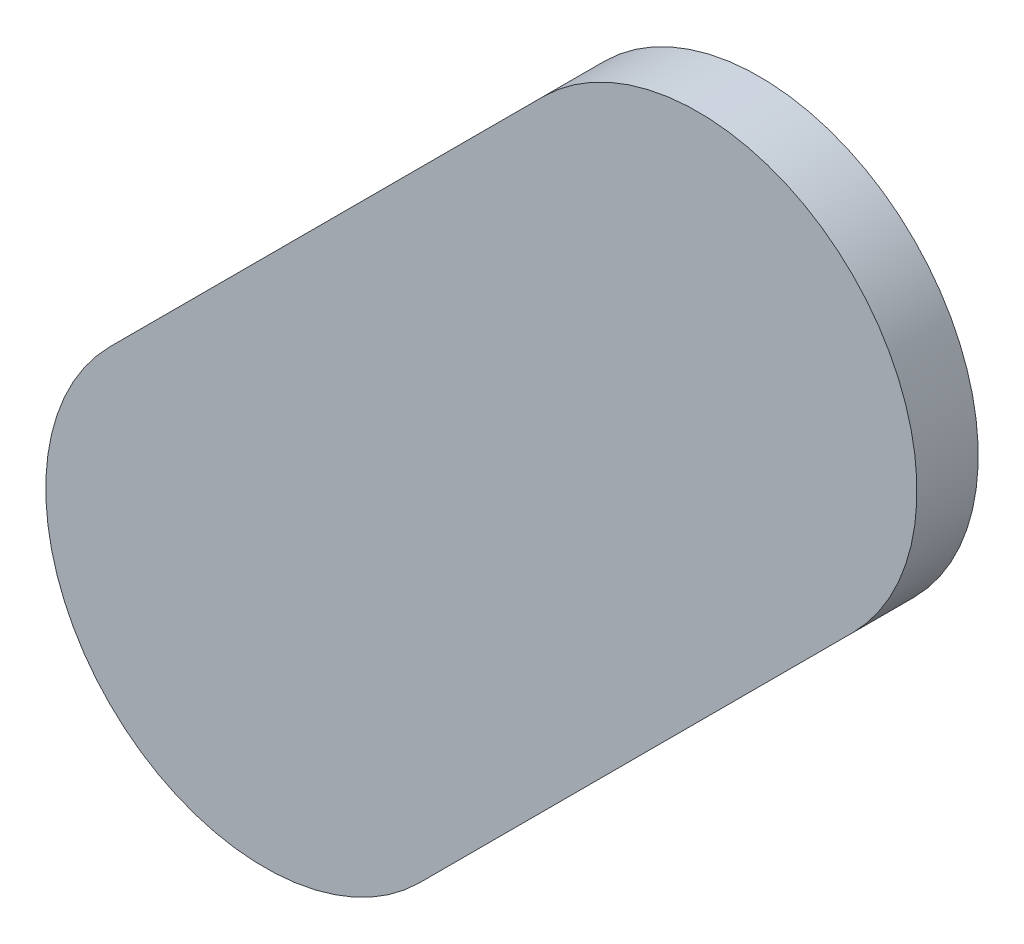
ISO-10303-21;
HEADER;
FILE_DESCRIPTION(('STEP AP214'),'2;1');
FILE_NAME('part.step','',(''),(''),'','','');
FILE_SCHEMA(('AUTOMOTIVE_DESIGN { 1 0 10303 214 1 1 1 1 }'));
ENDSEC;
DATA;
#1=APPLICATION_CONTEXT('core data for automotive mechanical design processes');
#2=APPLICATION_PROTOCOL_DEFINITION('international standard','automotive_design',2000,#1);
#3=PRODUCT_CONTEXT('',#1,'mechanical');
#4=PRODUCT('Part','Part','',(#3));
#5=PRODUCT_RELATED_PRODUCT_CATEGORY('part','',(#4));
#6=PRODUCT_DEFINITION_FORMATION('','',#4);
#7=PRODUCT_DEFINITION_CONTEXT('part definition',#1,'design');
#8=PRODUCT_DEFINITION('design','',#6,#7);
#9=PRODUCT_DEFINITION_SHAPE('','',#8);
#10=(LENGTH_UNIT() NAMED_UNIT(*) SI_UNIT(.MILLI.,.METRE.));
#11=(NAMED_UNIT(*) PLANE_ANGLE_UNIT() SI_UNIT($,.RADIAN.));
#12=(NAMED_UNIT(*) SI_UNIT($,.STERADIAN.) SOLID_ANGLE_UNIT());
#13=UNCERTAINTY_MEASURE_WITH_UNIT(LENGTH_MEASURE(1.E-05),#10,'distance_accuracy_value','');
#14=(GEOMETRIC_REPRESENTATION_CONTEXT(3) GLOBAL_UNCERTAINTY_ASSIGNED_CONTEXT((#13)) GLOBAL_UNIT_ASSIGNED_CONTEXT((#10,
#11,#12)) REPRESENTATION_CONTEXT('',''));
#15=CARTESIAN_POINT('',(0.,0.,0.));
#16=DIRECTION('',(0.,0.,1.));
#17=DIRECTION('',(1.,0.,0.));
#18=AXIS2_PLACEMENT_3D('',#15,#16,#17);
#19=CARTESIAN_POINT('',(86.75982394,100.84573684,0.));
#20=DIRECTION('',(-0.707106781186548,0.707106781186548,0.));
#21=DIRECTION('',(0.707106781186548,0.707106781186548,0.));
#22=AXIS2_PLACEMENT_3D('',#19,#20,#21);
#23=PLANE('',#22);
#24=DIRECTION('',(0.707106781186548,0.707106781186548,0.));
#25=VECTOR('',#24,1.);
#26=CARTESIAN_POINT('',(86.75982394,100.84573684,0.03556));
#27=LINE('',#26,#25);
#28=CARTESIAN_POINT('',(86.75982394,100.84573684,0.03556));
#29=VERTEX_POINT('',#28);
#30=CARTESIAN_POINT('',(87.0113322,101.0972451,0.03556));
#31=VERTEX_POINT('',#30);
#32=EDGE_CURVE('E11',#29,#31,#27,.T.);
#33=ORIENTED_EDGE('',*,*,#32,.F.);
#34=DIRECTION('',(0.,0.,1.));
#35=VECTOR('',#34,1.);
#36=CARTESIAN_POINT('',(86.75982394,100.84573684,0.));
#37=LINE('',#36,#35);
#38=CARTESIAN_POINT('',(86.75982394,100.84573684,0.));
#39=VERTEX_POINT('',#38);
#40=EDGE_CURVE('E24',#39,#29,#37,.T.);
#41=ORIENTED_EDGE('',*,*,#40,.F.);
#42=DIRECTION('',(0.707106781186548,0.707106781186548,0.));
#43=VECTOR('',#42,1.);
#44=CARTESIAN_POINT('',(86.75982394,100.84573684,0.));
#45=LINE('',#44,#43);
#46=CARTESIAN_POINT('',(87.0113322,101.0972451,0.));
#47=VERTEX_POINT('',#46);
#48=EDGE_CURVE('E75',#39,#47,#45,.T.);
#49=ORIENTED_EDGE('',*,*,#48,.T.);
#50=DIRECTION('',(0.,0.,1.));
#51=VECTOR('',#50,1.);
#52=CARTESIAN_POINT('',(87.0113322,101.0972451,0.));
#53=LINE('',#52,#51);
#54=EDGE_CURVE('E37',#47,#31,#53,.T.);
#55=ORIENTED_EDGE('',*,*,#54,.T.);
#56=EDGE_LOOP('',(#33,#41,#49,#55));
#57=FACE_BOUND('',#56,.T.);
#58=ADVANCED_FACE('F17',(#57),#23,.F.);
#59=CARTESIAN_POINT('',(86.92152923,101.18704807,0.));
#60=DIRECTION('',(0.,0.,-1.));
#61=DIRECTION('',(0.707106781186492,-0.707106781186604,0.));
#62=AXIS2_PLACEMENT_3D('',#59,#60,#61);
#63=CYLINDRICAL_SURFACE('',#62,0.127000578115382);
#64=CARTESIAN_POINT('',(86.92152923,101.18704807,0.03556));
#65=DIRECTION('',(0.,0.,1.));
#66=DIRECTION('',(0.707106781186492,-0.707106781186604,0.));
#67=AXIS2_PLACEMENT_3D('',#64,#65,#66);
#68=CIRCLE('',#67,0.127000578115382);
#69=CARTESIAN_POINT('',(86.83172626,101.27685104,0.03556));
#70=VERTEX_POINT('',#69);
#71=EDGE_CURVE('E83',#31,#70,#68,.T.);
#72=ORIENTED_EDGE('',*,*,#71,.F.);
#73=ORIENTED_EDGE('',*,*,#54,.F.);
#74=CARTESIAN_POINT('',(86.92152923,101.18704807,0.));
#75=DIRECTION('',(0.,0.,1.));
#76=DIRECTION('',(0.707106781186492,-0.707106781186604,0.));
#77=AXIS2_PLACEMENT_3D('',#74,#75,#76);
#78=CIRCLE('',#77,0.127000578115382);
#79=CARTESIAN_POINT('',(86.83172626,101.27685104,0.));
#80=VERTEX_POINT('',#79);
#81=EDGE_CURVE('E81',#47,#80,#78,.T.);
#82=ORIENTED_EDGE('',*,*,#81,.T.);
#83=DIRECTION('',(0.,0.,1.));
#84=VECTOR('',#83,1.);
#85=CARTESIAN_POINT('',(86.83172626,101.27685104,0.));
#86=LINE('',#85,#84);
#87=EDGE_CURVE('E67',#80,#70,#86,.T.);
#88=ORIENTED_EDGE('',*,*,#87,.T.);
#89=EDGE_LOOP('',(#72,#73,#82,#88));
#90=FACE_BOUND('',#89,.T.);
#91=ADVANCED_FACE('F89',(#90),#63,.T.);
#92=CARTESIAN_POINT('',(86.83172626,101.27685104,0.));
#93=DIRECTION('',(0.707106781186548,-0.707106781186548,0.));
#94=DIRECTION('',(-0.707106781186548,-0.707106781186548,0.));
#95=AXIS2_PLACEMENT_3D('',#92,#93,#94);
#96=PLANE('',#95);
#97=DIRECTION('',(-0.707106781186548,-0.707106781186548,0.));
#98=VECTOR('',#97,1.);
#99=CARTESIAN_POINT('',(86.83172626,101.27685104,0.03556));
#100=LINE('',#99,#98);
#101=CARTESIAN_POINT('',(86.580218,101.02534278,0.03556));
#102=VERTEX_POINT('',#101);
#103=EDGE_CURVE('E71',#70,#102,#100,.T.);
#104=ORIENTED_EDGE('',*,*,#103,.F.);
#105=ORIENTED_EDGE('',*,*,#87,.F.);
#106=DIRECTION('',(-0.707106781186548,-0.707106781186548,0.));
#107=VECTOR('',#106,1.);
#108=CARTESIAN_POINT('',(86.83172626,101.27685104,0.));
#109=LINE('',#108,#107);
#110=CARTESIAN_POINT('',(86.580218,101.02534278,0.));
#111=VERTEX_POINT('',#110);
#112=EDGE_CURVE('E63',#80,#111,#109,.T.);
#113=ORIENTED_EDGE('',*,*,#112,.T.);
#114=DIRECTION('',(0.,0.,1.));
#115=VECTOR('',#114,1.);
#116=CARTESIAN_POINT('',(86.580218,101.02534278,0.));
#117=LINE('',#116,#115);
#118=EDGE_CURVE('E53',#111,#102,#117,.T.);
#119=ORIENTED_EDGE('',*,*,#118,.T.);
#120=EDGE_LOOP('',(#104,#105,#113,#119));
#121=FACE_BOUND('',#120,.T.);
#122=ADVANCED_FACE('F66',(#121),#96,.F.);
#123=CARTESIAN_POINT('',(86.67002097,100.93553981,0.));
#124=DIRECTION('',(0.,0.,-1.));
#125=DIRECTION('',(-0.707106781186604,0.707106781186492,0.));
#126=AXIS2_PLACEMENT_3D('',#123,#124,#125);
#127=CYLINDRICAL_SURFACE('',#126,0.127000578115389);
#128=CARTESIAN_POINT('',(86.67002097,100.93553981,0.03556));
#129=DIRECTION('',(0.,0.,1.));
#130=DIRECTION('',(-0.707106781186604,0.707106781186492,0.));
#131=AXIS2_PLACEMENT_3D('',#128,#129,#130);
#132=CIRCLE('',#131,0.127000578115389);
#133=EDGE_CURVE('E59',#102,#29,#132,.T.);
#134=ORIENTED_EDGE('',*,*,#133,.F.);
#135=ORIENTED_EDGE('',*,*,#118,.F.);
#136=CARTESIAN_POINT('',(86.67002097,100.93553981,0.));
#137=DIRECTION('',(0.,0.,1.));
#138=DIRECTION('',(-0.707106781186604,0.707106781186492,0.));
#139=AXIS2_PLACEMENT_3D('',#136,#137,#138);
#140=CIRCLE('',#139,0.127000578115389);
#141=EDGE_CURVE('E57',#111,#39,#140,.T.);
#142=ORIENTED_EDGE('',*,*,#141,.T.);
#143=ORIENTED_EDGE('',*,*,#40,.T.);
#144=EDGE_LOOP('',(#134,#135,#142,#143));
#145=FACE_BOUND('',#144,.T.);
#146=ADVANCED_FACE('F55',(#145),#127,.T.);
#147=CARTESIAN_POINT('',(86.75982394,100.84573684,0.));
#148=DIRECTION('',(0.,0.,-1.));
#149=DIRECTION('',(-1.,0.,0.));
#150=AXIS2_PLACEMENT_3D('',#147,#148,#149);
#151=PLANE('',#150);
#152=ORIENTED_EDGE('',*,*,#141,.F.);
#153=ORIENTED_EDGE('',*,*,#112,.F.);
#154=ORIENTED_EDGE('',*,*,#81,.F.);
#155=ORIENTED_EDGE('',*,*,#48,.F.);
#156=EDGE_LOOP('',(#152,#153,#154,#155));
#157=FACE_BOUND('',#156,.T.);
#158=ADVANCED_FACE('F74',(#157),#151,.T.);
#159=CARTESIAN_POINT('',(86.75982394,100.84573684,0.03556));
#160=DIRECTION('',(0.,0.,-1.));
#161=DIRECTION('',(-1.,0.,0.));
#162=AXIS2_PLACEMENT_3D('',#159,#160,#161);
#163=PLANE('',#162);
#164=ORIENTED_EDGE('',*,*,#32,.T.);
#165=ORIENTED_EDGE('',*,*,#71,.T.);
#166=ORIENTED_EDGE('',*,*,#103,.T.);
#167=ORIENTED_EDGE('',*,*,#133,.T.);
#168=EDGE_LOOP('',(#164,#165,#166,#167));
#169=FACE_BOUND('',#168,.T.);
#170=ADVANCED_FACE('F91',(#169),#163,.F.);
#171=CLOSED_SHELL('',(#58,#91,#122,#146,#158,#170));
#172=MANIFOLD_SOLID_BREP('B1',#171);
#173=ADVANCED_BREP_SHAPE_REPRESENTATION('',(#18,#172),#14);
#174=SHAPE_DEFINITION_REPRESENTATION(#9,#173);
ENDSEC;
END-ISO-10303-21;
